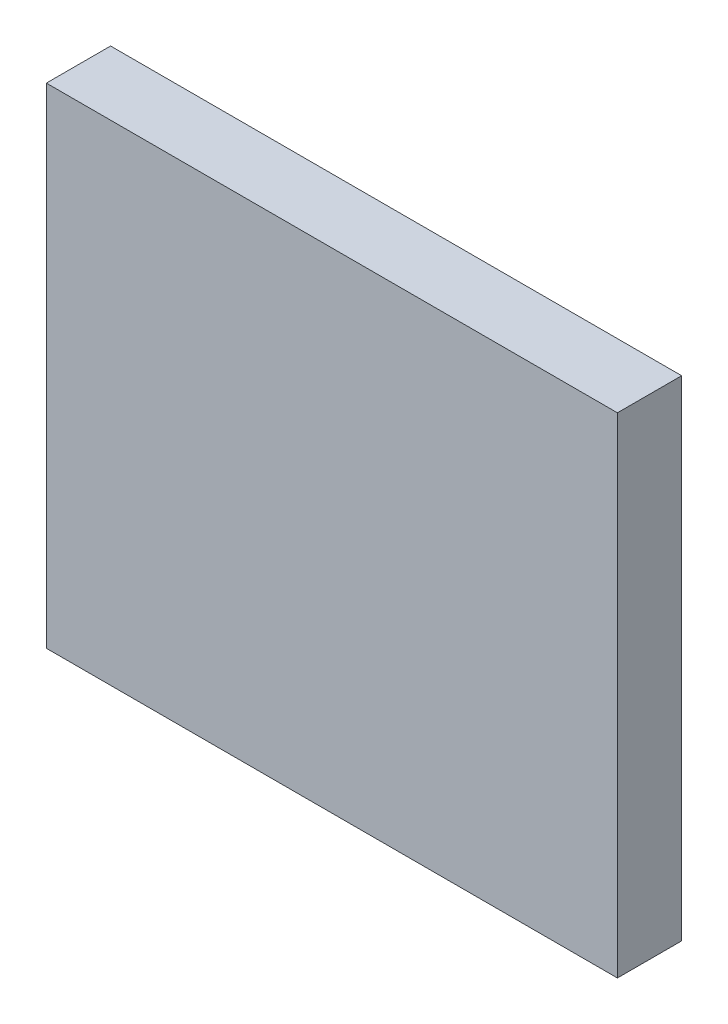
ISO-10303-21;
HEADER;
FILE_DESCRIPTION(('STEP AP214'),'2;1');
FILE_NAME('part.step','',(''),(''),'','','');
FILE_SCHEMA(('AUTOMOTIVE_DESIGN { 1 0 10303 214 1 1 1 1 }'));
ENDSEC;
DATA;
#1=APPLICATION_CONTEXT('core data for automotive mechanical design processes');
#2=APPLICATION_PROTOCOL_DEFINITION('international standard','automotive_design',2000,#1);
#3=PRODUCT_CONTEXT('',#1,'mechanical');
#4=PRODUCT('Part','Part','',(#3));
#5=PRODUCT_RELATED_PRODUCT_CATEGORY('part','',(#4));
#6=PRODUCT_DEFINITION_FORMATION('','',#4);
#7=PRODUCT_DEFINITION_CONTEXT('part definition',#1,'design');
#8=PRODUCT_DEFINITION('design','',#6,#7);
#9=PRODUCT_DEFINITION_SHAPE('','',#8);
#10=(LENGTH_UNIT() NAMED_UNIT(*) SI_UNIT(.MILLI.,.METRE.));
#11=(NAMED_UNIT(*) PLANE_ANGLE_UNIT() SI_UNIT($,.RADIAN.));
#12=(NAMED_UNIT(*) SI_UNIT($,.STERADIAN.) SOLID_ANGLE_UNIT());
#13=UNCERTAINTY_MEASURE_WITH_UNIT(LENGTH_MEASURE(1.E-05),#10,'distance_accuracy_value','');
#14=(GEOMETRIC_REPRESENTATION_CONTEXT(3) GLOBAL_UNCERTAINTY_ASSIGNED_CONTEXT((#13)) GLOBAL_UNIT_ASSIGNED_CONTEXT((#10,
#11,#12)) REPRESENTATION_CONTEXT('',''));
#15=CARTESIAN_POINT('',(0.,0.,0.));
#16=DIRECTION('',(0.,0.,1.));
#17=DIRECTION('',(1.,0.,0.));
#18=AXIS2_PLACEMENT_3D('',#15,#16,#17);
#19=CARTESIAN_POINT('',(-4.445,-3.81,1.));
#20=DIRECTION('',(1.,0.,0.));
#21=DIRECTION('',(0.,0.,-1.));
#22=AXIS2_PLACEMENT_3D('',#19,#20,#21);
#23=PLANE('',#22);
#24=DIRECTION('',(0.,-1.,0.));
#25=VECTOR('',#24,1.);
#26=CARTESIAN_POINT('',(-4.445,-3.81,0.));
#27=LINE('',#26,#25);
#28=CARTESIAN_POINT('',(-4.445,3.81,0.));
#29=VERTEX_POINT('',#28);
#30=CARTESIAN_POINT('',(-4.445,-3.81,0.));
#31=VERTEX_POINT('',#30);
#32=EDGE_CURVE('E95',#29,#31,#27,.T.);
#33=ORIENTED_EDGE('',*,*,#32,.T.);
#34=DIRECTION('',(0.,0.,-1.));
#35=VECTOR('',#34,1.);
#36=CARTESIAN_POINT('',(-4.445,-3.81,1.));
#37=LINE('',#36,#35);
#38=CARTESIAN_POINT('',(-4.445,-3.81,1.));
#39=VERTEX_POINT('',#38);
#40=EDGE_CURVE('E11',#39,#31,#37,.T.);
#41=ORIENTED_EDGE('',*,*,#40,.F.);
#42=DIRECTION('',(0.,-1.,0.));
#43=VECTOR('',#42,1.);
#44=CARTESIAN_POINT('',(-4.445,-3.81,1.));
#45=LINE('',#44,#43);
#46=CARTESIAN_POINT('',(-4.445,3.81,1.));
#47=VERTEX_POINT('',#46);
#48=EDGE_CURVE('E83',#47,#39,#45,.T.);
#49=ORIENTED_EDGE('',*,*,#48,.F.);
#50=DIRECTION('',(0.,0.,-1.));
#51=VECTOR('',#50,1.);
#52=CARTESIAN_POINT('',(-4.445,3.81,1.));
#53=LINE('',#52,#51);
#54=EDGE_CURVE('E91',#47,#29,#53,.T.);
#55=ORIENTED_EDGE('',*,*,#54,.T.);
#56=EDGE_LOOP('',(#33,#41,#49,#55));
#57=FACE_BOUND('',#56,.T.);
#58=ADVANCED_FACE('F32',(#57),#23,.F.);
#59=CARTESIAN_POINT('',(4.445,-3.81,1.));
#60=DIRECTION('',(0.,1.,0.));
#61=DIRECTION('',(0.,0.,1.));
#62=AXIS2_PLACEMENT_3D('',#59,#60,#61);
#63=PLANE('',#62);
#64=DIRECTION('',(1.,0.,0.));
#65=VECTOR('',#64,1.);
#66=CARTESIAN_POINT('',(4.445,-3.81,0.));
#67=LINE('',#66,#65);
#68=CARTESIAN_POINT('',(4.445,-3.81,0.));
#69=VERTEX_POINT('',#68);
#70=EDGE_CURVE('E87',#31,#69,#67,.T.);
#71=ORIENTED_EDGE('',*,*,#70,.T.);
#72=DIRECTION('',(0.,0.,-1.));
#73=VECTOR('',#72,1.);
#74=CARTESIAN_POINT('',(4.445,-3.81,1.));
#75=LINE('',#74,#73);
#76=CARTESIAN_POINT('',(4.445,-3.81,1.));
#77=VERTEX_POINT('',#76);
#78=EDGE_CURVE('E40',#77,#69,#75,.T.);
#79=ORIENTED_EDGE('',*,*,#78,.F.);
#80=DIRECTION('',(1.,0.,0.));
#81=VECTOR('',#80,1.);
#82=CARTESIAN_POINT('',(4.445,-3.81,1.));
#83=LINE('',#82,#81);
#84=EDGE_CURVE('E78',#39,#77,#83,.T.);
#85=ORIENTED_EDGE('',*,*,#84,.F.);
#86=ORIENTED_EDGE('',*,*,#40,.T.);
#87=EDGE_LOOP('',(#71,#79,#85,#86));
#88=FACE_BOUND('',#87,.T.);
#89=ADVANCED_FACE('F86',(#88),#63,.F.);
#90=CARTESIAN_POINT('',(4.445,3.81,1.));
#91=DIRECTION('',(-1.,0.,0.));
#92=DIRECTION('',(0.,0.,1.));
#93=AXIS2_PLACEMENT_3D('',#90,#91,#92);
#94=PLANE('',#93);
#95=DIRECTION('',(0.,1.,0.));
#96=VECTOR('',#95,1.);
#97=CARTESIAN_POINT('',(4.445,3.81,0.));
#98=LINE('',#97,#96);
#99=CARTESIAN_POINT('',(4.445,3.81,0.));
#100=VERTEX_POINT('',#99);
#101=EDGE_CURVE('E65',#69,#100,#98,.T.);
#102=ORIENTED_EDGE('',*,*,#101,.T.);
#103=DIRECTION('',(0.,0.,-1.));
#104=VECTOR('',#103,1.);
#105=CARTESIAN_POINT('',(4.445,3.81,1.));
#106=LINE('',#105,#104);
#107=CARTESIAN_POINT('',(4.445,3.81,1.));
#108=VERTEX_POINT('',#107);
#109=EDGE_CURVE('E88',#108,#100,#106,.T.);
#110=ORIENTED_EDGE('',*,*,#109,.F.);
#111=DIRECTION('',(0.,1.,0.));
#112=VECTOR('',#111,1.);
#113=CARTESIAN_POINT('',(4.445,3.81,1.));
#114=LINE('',#113,#112);
#115=EDGE_CURVE('E81',#77,#108,#114,.T.);
#116=ORIENTED_EDGE('',*,*,#115,.F.);
#117=ORIENTED_EDGE('',*,*,#78,.T.);
#118=EDGE_LOOP('',(#102,#110,#116,#117));
#119=FACE_BOUND('',#118,.T.);
#120=ADVANCED_FACE('F89',(#119),#94,.F.);
#121=CARTESIAN_POINT('',(-4.445,3.81,1.));
#122=DIRECTION('',(0.,-1.,0.));
#123=DIRECTION('',(0.,0.,-1.));
#124=AXIS2_PLACEMENT_3D('',#121,#122,#123);
#125=PLANE('',#124);
#126=DIRECTION('',(-1.,0.,0.));
#127=VECTOR('',#126,1.);
#128=CARTESIAN_POINT('',(-4.445,3.81,0.));
#129=LINE('',#128,#127);
#130=EDGE_CURVE('E71',#100,#29,#129,.T.);
#131=ORIENTED_EDGE('',*,*,#130,.T.);
#132=ORIENTED_EDGE('',*,*,#54,.F.);
#133=DIRECTION('',(-1.,0.,0.));
#134=VECTOR('',#133,1.);
#135=CARTESIAN_POINT('',(-4.445,3.81,1.));
#136=LINE('',#135,#134);
#137=EDGE_CURVE('E48',#108,#47,#136,.T.);
#138=ORIENTED_EDGE('',*,*,#137,.F.);
#139=ORIENTED_EDGE('',*,*,#109,.T.);
#140=EDGE_LOOP('',(#131,#132,#138,#139));
#141=FACE_BOUND('',#140,.T.);
#142=ADVANCED_FACE('F102',(#141),#125,.F.);
#143=CARTESIAN_POINT('',(0.,0.,1.));
#144=DIRECTION('',(0.,0.,-1.));
#145=DIRECTION('',(-1.,0.,0.));
#146=AXIS2_PLACEMENT_3D('',#143,#144,#145);
#147=PLANE('',#146);
#148=ORIENTED_EDGE('',*,*,#48,.T.);
#149=ORIENTED_EDGE('',*,*,#84,.T.);
#150=ORIENTED_EDGE('',*,*,#115,.T.);
#151=ORIENTED_EDGE('',*,*,#137,.T.);
#152=EDGE_LOOP('',(#148,#149,#150,#151));
#153=FACE_BOUND('',#152,.T.);
#154=ADVANCED_FACE('F79',(#153),#147,.F.);
#155=CARTESIAN_POINT('',(0.,0.,0.));
#156=DIRECTION('',(0.,0.,-1.));
#157=DIRECTION('',(-1.,0.,0.));
#158=AXIS2_PLACEMENT_3D('',#155,#156,#157);
#159=PLANE('',#158);
#160=ORIENTED_EDGE('',*,*,#32,.F.);
#161=ORIENTED_EDGE('',*,*,#130,.F.);
#162=ORIENTED_EDGE('',*,*,#101,.F.);
#163=ORIENTED_EDGE('',*,*,#70,.F.);
#164=EDGE_LOOP('',(#160,#161,#162,#163));
#165=FACE_BOUND('',#164,.T.);
#166=ADVANCED_FACE('F105',(#165),#159,.T.);
#167=CLOSED_SHELL('',(#58,#89,#120,#142,#154,#166));
#168=MANIFOLD_SOLID_BREP('B2',#167);
#169=ADVANCED_BREP_SHAPE_REPRESENTATION('',(#18,#168),#14);
#170=SHAPE_DEFINITION_REPRESENTATION(#9,#169);
ENDSEC;
END-ISO-10303-21;
